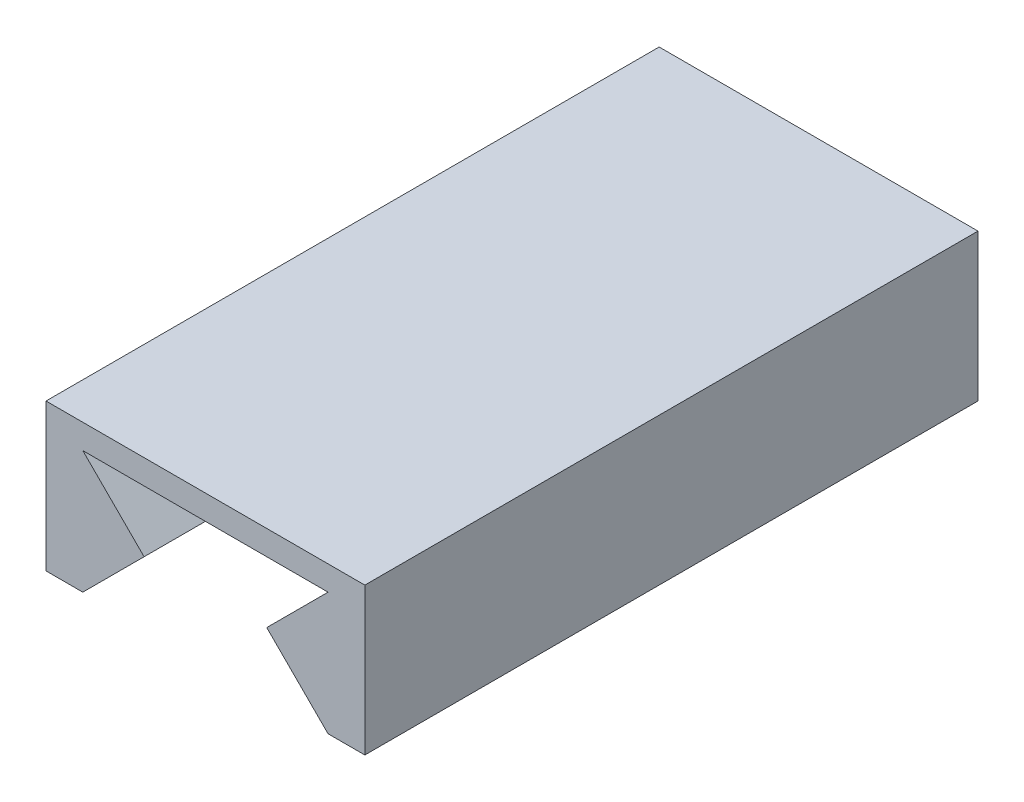
ISO-10303-21;
HEADER;
FILE_DESCRIPTION(('STEP AP214'),'2;1');
FILE_NAME('part.step','',(''),(''),'','','');
FILE_SCHEMA(('AUTOMOTIVE_DESIGN { 1 0 10303 214 1 1 1 1 }'));
ENDSEC;
DATA;
#1=APPLICATION_CONTEXT('core data for automotive mechanical design processes');
#2=APPLICATION_PROTOCOL_DEFINITION('international standard','automotive_design',2000,#1);
#3=PRODUCT_CONTEXT('',#1,'mechanical');
#4=PRODUCT('Part','Part','',(#3));
#5=PRODUCT_RELATED_PRODUCT_CATEGORY('part','',(#4));
#6=PRODUCT_DEFINITION_FORMATION('','',#4);
#7=PRODUCT_DEFINITION_CONTEXT('part definition',#1,'design');
#8=PRODUCT_DEFINITION('design','',#6,#7);
#9=PRODUCT_DEFINITION_SHAPE('','',#8);
#10=(LENGTH_UNIT() NAMED_UNIT(*) SI_UNIT(.MILLI.,.METRE.));
#11=(NAMED_UNIT(*) PLANE_ANGLE_UNIT() SI_UNIT($,.RADIAN.));
#12=(NAMED_UNIT(*) SI_UNIT($,.STERADIAN.) SOLID_ANGLE_UNIT());
#13=UNCERTAINTY_MEASURE_WITH_UNIT(LENGTH_MEASURE(1.E-05),#10,'distance_accuracy_value','');
#14=(GEOMETRIC_REPRESENTATION_CONTEXT(3) GLOBAL_UNCERTAINTY_ASSIGNED_CONTEXT((#13)) GLOBAL_UNIT_ASSIGNED_CONTEXT((#10,
#11,#12)) REPRESENTATION_CONTEXT('',''));
#15=CARTESIAN_POINT('',(0.,0.,0.));
#16=DIRECTION('',(0.,0.,1.));
#17=DIRECTION('',(1.,0.,0.));
#18=AXIS2_PLACEMENT_3D('',#15,#16,#17);
#19=CARTESIAN_POINT('',(0.,0.,50.));
#20=DIRECTION('',(-0.707106781186544,-0.707106781186552,0.));
#21=DIRECTION('',(0.707106781186551,-0.707106781186544,0.));
#22=AXIS2_PLACEMENT_3D('',#19,#20,#21);
#23=PLANE('',#22);
#24=DIRECTION('',(-0.707106781186551,0.707106781186544,0.));
#25=VECTOR('',#24,1.);
#26=CARTESIAN_POINT('',(0.,0.,0.));
#27=LINE('',#26,#25);
#28=CARTESIAN_POINT('',(0.,0.,0.));
#29=VERTEX_POINT('',#28);
#30=CARTESIAN_POINT('',(-5.00000000000006,5.,0.));
#31=VERTEX_POINT('',#30);
#32=EDGE_CURVE('E140',#29,#31,#27,.T.);
#33=ORIENTED_EDGE('',*,*,#32,.T.);
#34=DIRECTION('',(0.,0.,-1.));
#35=VECTOR('',#34,1.);
#36=CARTESIAN_POINT('',(-5.00000000000006,5.,50.));
#37=LINE('',#36,#35);
#38=CARTESIAN_POINT('',(-5.00000000000006,5.,50.));
#39=VERTEX_POINT('',#38);
#40=EDGE_CURVE('E11',#39,#31,#37,.T.);
#41=ORIENTED_EDGE('',*,*,#40,.F.);
#42=DIRECTION('',(-0.707106781186551,0.707106781186544,0.));
#43=VECTOR('',#42,1.);
#44=CARTESIAN_POINT('',(0.,0.,50.));
#45=LINE('',#44,#43);
#46=CARTESIAN_POINT('',(0.,0.,50.));
#47=VERTEX_POINT('',#46);
#48=EDGE_CURVE('E158',#47,#39,#45,.T.);
#49=ORIENTED_EDGE('',*,*,#48,.F.);
#50=DIRECTION('',(0.,0.,-1.));
#51=VECTOR('',#50,1.);
#52=CARTESIAN_POINT('',(0.,0.,50.));
#53=LINE('',#52,#51);
#54=EDGE_CURVE('E136',#47,#29,#53,.T.);
#55=ORIENTED_EDGE('',*,*,#54,.T.);
#56=EDGE_LOOP('',(#33,#41,#49,#55));
#57=FACE_BOUND('',#56,.T.);
#58=ADVANCED_FACE('F32',(#57),#23,.F.);
#59=CARTESIAN_POINT('',(-5.00000000000006,5.,50.));
#60=DIRECTION('',(0.,1.,0.));
#61=DIRECTION('',(-1.,0.,0.));
#62=AXIS2_PLACEMENT_3D('',#59,#60,#61);
#63=PLANE('',#62);
#64=DIRECTION('',(1.,0.,0.));
#65=VECTOR('',#64,1.);
#66=CARTESIAN_POINT('',(-5.00000000000006,5.,0.));
#67=LINE('',#66,#65);
#68=CARTESIAN_POINT('',(14.9999999999999,5.,0.));
#69=VERTEX_POINT('',#68);
#70=EDGE_CURVE('E143',#31,#69,#67,.T.);
#71=ORIENTED_EDGE('',*,*,#70,.T.);
#72=DIRECTION('',(0.,0.,-1.));
#73=VECTOR('',#72,1.);
#74=CARTESIAN_POINT('',(14.9999999999999,5.,50.));
#75=LINE('',#74,#73);
#76=CARTESIAN_POINT('',(14.9999999999999,5.,50.));
#77=VERTEX_POINT('',#76);
#78=EDGE_CURVE('E40',#77,#69,#75,.T.);
#79=ORIENTED_EDGE('',*,*,#78,.F.);
#80=DIRECTION('',(1.,0.,0.));
#81=VECTOR('',#80,1.);
#82=CARTESIAN_POINT('',(-5.00000000000006,5.,50.));
#83=LINE('',#82,#81);
#84=EDGE_CURVE('E97',#39,#77,#83,.T.);
#85=ORIENTED_EDGE('',*,*,#84,.F.);
#86=ORIENTED_EDGE('',*,*,#40,.T.);
#87=EDGE_LOOP('',(#71,#79,#85,#86));
#88=FACE_BOUND('',#87,.T.);
#89=ADVANCED_FACE('F207',(#88),#63,.F.);
#90=CARTESIAN_POINT('',(14.9999999999999,5.,50.));
#91=DIRECTION('',(0.707106781186544,-0.707106781186551,0.));
#92=DIRECTION('',(0.707106781186551,0.707106781186544,0.));
#93=AXIS2_PLACEMENT_3D('',#90,#91,#92);
#94=PLANE('',#93);
#95=DIRECTION('',(-0.707106781186551,-0.707106781186544,0.));
#96=VECTOR('',#95,1.);
#97=CARTESIAN_POINT('',(14.9999999999999,5.,0.));
#98=LINE('',#97,#96);
#99=CARTESIAN_POINT('',(9.99999999999989,0.,0.));
#100=VERTEX_POINT('',#99);
#101=EDGE_CURVE('E145',#69,#100,#98,.T.);
#102=ORIENTED_EDGE('',*,*,#101,.T.);
#103=DIRECTION('',(0.,0.,-1.));
#104=VECTOR('',#103,1.);
#105=CARTESIAN_POINT('',(9.99999999999989,0.,50.));
#106=LINE('',#105,#104);
#107=CARTESIAN_POINT('',(9.99999999999989,0.,50.));
#108=VERTEX_POINT('',#107);
#109=EDGE_CURVE('E171',#108,#100,#106,.T.);
#110=ORIENTED_EDGE('',*,*,#109,.F.);
#111=DIRECTION('',(-0.707106781186551,-0.707106781186544,0.));
#112=VECTOR('',#111,1.);
#113=CARTESIAN_POINT('',(14.9999999999999,5.,50.));
#114=LINE('',#113,#112);
#115=EDGE_CURVE('E179',#77,#108,#114,.T.);
#116=ORIENTED_EDGE('',*,*,#115,.F.);
#117=ORIENTED_EDGE('',*,*,#78,.T.);
#118=EDGE_LOOP('',(#102,#110,#116,#117));
#119=FACE_BOUND('',#118,.T.);
#120=ADVANCED_FACE('F177',(#119),#94,.F.);
#121=CARTESIAN_POINT('',(9.99999999999989,0.,50.));
#122=DIRECTION('',(0.707106781186543,0.707106781186552,0.));
#123=DIRECTION('',(-0.707106781186552,0.707106781186543,0.));
#124=AXIS2_PLACEMENT_3D('',#121,#122,#123);
#125=PLANE('',#124);
#126=DIRECTION('',(0.707106781186552,-0.707106781186543,0.));
#127=VECTOR('',#126,1.);
#128=CARTESIAN_POINT('',(9.99999999999989,0.,0.));
#129=LINE('',#128,#127);
#130=CARTESIAN_POINT('',(14.9999999999999,-5.,0.));
#131=VERTEX_POINT('',#130);
#132=EDGE_CURVE('E147',#100,#131,#129,.T.);
#133=ORIENTED_EDGE('',*,*,#132,.T.);
#134=DIRECTION('',(0.,0.,-1.));
#135=VECTOR('',#134,1.);
#136=CARTESIAN_POINT('',(14.9999999999999,-5.,50.));
#137=LINE('',#136,#135);
#138=CARTESIAN_POINT('',(14.9999999999999,-5.,50.));
#139=VERTEX_POINT('',#138);
#140=EDGE_CURVE('E168',#139,#131,#137,.T.);
#141=ORIENTED_EDGE('',*,*,#140,.F.);
#142=DIRECTION('',(0.707106781186552,-0.707106781186543,0.));
#143=VECTOR('',#142,1.);
#144=CARTESIAN_POINT('',(9.99999999999989,0.,50.));
#145=LINE('',#144,#143);
#146=EDGE_CURVE('E197',#108,#139,#145,.T.);
#147=ORIENTED_EDGE('',*,*,#146,.F.);
#148=ORIENTED_EDGE('',*,*,#109,.T.);
#149=EDGE_LOOP('',(#133,#141,#147,#148));
#150=FACE_BOUND('',#149,.T.);
#151=ADVANCED_FACE('F188',(#150),#125,.F.);
#152=CARTESIAN_POINT('',(14.9999999999999,-5.,50.));
#153=DIRECTION('',(0.,1.,0.));
#154=DIRECTION('',(0.,0.,1.));
#155=AXIS2_PLACEMENT_3D('',#152,#153,#154);
#156=PLANE('',#155);
#157=DIRECTION('',(1.,0.,0.));
#158=VECTOR('',#157,1.);
#159=CARTESIAN_POINT('',(14.9999999999999,-5.,0.));
#160=LINE('',#159,#158);
#161=CARTESIAN_POINT('',(17.9999999999999,-5.,0.));
#162=VERTEX_POINT('',#161);
#163=EDGE_CURVE('E149',#131,#162,#160,.T.);
#164=ORIENTED_EDGE('',*,*,#163,.T.);
#165=DIRECTION('',(0.,0.,-1.));
#166=VECTOR('',#165,1.);
#167=CARTESIAN_POINT('',(17.9999999999999,-5.,50.));
#168=LINE('',#167,#166);
#169=CARTESIAN_POINT('',(17.9999999999999,-5.,50.));
#170=VERTEX_POINT('',#169);
#171=EDGE_CURVE('E165',#170,#162,#168,.T.);
#172=ORIENTED_EDGE('',*,*,#171,.F.);
#173=DIRECTION('',(1.,0.,0.));
#174=VECTOR('',#173,1.);
#175=CARTESIAN_POINT('',(14.9999999999999,-5.,50.));
#176=LINE('',#175,#174);
#177=EDGE_CURVE('E194',#139,#170,#176,.T.);
#178=ORIENTED_EDGE('',*,*,#177,.F.);
#179=ORIENTED_EDGE('',*,*,#140,.T.);
#180=EDGE_LOOP('',(#164,#172,#178,#179));
#181=FACE_BOUND('',#180,.T.);
#182=ADVANCED_FACE('F192',(#181),#156,.F.);
#183=CARTESIAN_POINT('',(17.9999999999999,-5.,50.));
#184=DIRECTION('',(-1.,0.,0.));
#185=DIRECTION('',(0.,-1.,0.));
#186=AXIS2_PLACEMENT_3D('',#183,#184,#185);
#187=PLANE('',#186);
#188=DIRECTION('',(0.,1.,0.));
#189=VECTOR('',#188,1.);
#190=CARTESIAN_POINT('',(17.9999999999999,-5.,0.));
#191=LINE('',#190,#189);
#192=CARTESIAN_POINT('',(17.9999999999999,7.,0.));
#193=VERTEX_POINT('',#192);
#194=EDGE_CURVE('E151',#162,#193,#191,.T.);
#195=ORIENTED_EDGE('',*,*,#194,.T.);
#196=DIRECTION('',(0.,0.,-1.));
#197=VECTOR('',#196,1.);
#198=CARTESIAN_POINT('',(17.9999999999999,7.,50.));
#199=LINE('',#198,#197);
#200=CARTESIAN_POINT('',(17.9999999999999,7.,50.));
#201=VERTEX_POINT('',#200);
#202=EDGE_CURVE('E162',#201,#193,#199,.T.);
#203=ORIENTED_EDGE('',*,*,#202,.F.);
#204=DIRECTION('',(0.,1.,0.));
#205=VECTOR('',#204,1.);
#206=CARTESIAN_POINT('',(17.9999999999999,-5.,50.));
#207=LINE('',#206,#205);
#208=EDGE_CURVE('E196',#170,#201,#207,.T.);
#209=ORIENTED_EDGE('',*,*,#208,.F.);
#210=ORIENTED_EDGE('',*,*,#171,.T.);
#211=EDGE_LOOP('',(#195,#203,#209,#210));
#212=FACE_BOUND('',#211,.T.);
#213=ADVANCED_FACE('F219',(#212),#187,.F.);
#214=CARTESIAN_POINT('',(17.9999999999999,7.,50.));
#215=DIRECTION('',(0.,-1.,0.));
#216=DIRECTION('',(0.,0.,-1.));
#217=AXIS2_PLACEMENT_3D('',#214,#215,#216);
#218=PLANE('',#217);
#219=DIRECTION('',(-1.,0.,0.));
#220=VECTOR('',#219,1.);
#221=CARTESIAN_POINT('',(17.9999999999999,7.,0.));
#222=LINE('',#221,#220);
#223=CARTESIAN_POINT('',(-8.00000000000006,7.,0.));
#224=VERTEX_POINT('',#223);
#225=EDGE_CURVE('E153',#193,#224,#222,.T.);
#226=ORIENTED_EDGE('',*,*,#225,.T.);
#227=DIRECTION('',(0.,0.,-1.));
#228=VECTOR('',#227,1.);
#229=CARTESIAN_POINT('',(-8.00000000000006,7.,50.));
#230=LINE('',#229,#228);
#231=CARTESIAN_POINT('',(-8.00000000000006,7.,50.));
#232=VERTEX_POINT('',#231);
#233=EDGE_CURVE('E131',#232,#224,#230,.T.);
#234=ORIENTED_EDGE('',*,*,#233,.F.);
#235=DIRECTION('',(-1.,0.,0.));
#236=VECTOR('',#235,1.);
#237=CARTESIAN_POINT('',(17.9999999999999,7.,50.));
#238=LINE('',#237,#236);
#239=EDGE_CURVE('E122',#201,#232,#238,.T.);
#240=ORIENTED_EDGE('',*,*,#239,.F.);
#241=ORIENTED_EDGE('',*,*,#202,.T.);
#242=EDGE_LOOP('',(#226,#234,#240,#241));
#243=FACE_BOUND('',#242,.T.);
#244=ADVANCED_FACE('F222',(#243),#218,.F.);
#245=CARTESIAN_POINT('',(-8.00000000000006,7.,50.));
#246=DIRECTION('',(1.,0.,0.));
#247=DIRECTION('',(0.,1.,0.));
#248=AXIS2_PLACEMENT_3D('',#245,#246,#247);
#249=PLANE('',#248);
#250=DIRECTION('',(0.,-1.,0.));
#251=VECTOR('',#250,1.);
#252=CARTESIAN_POINT('',(-8.00000000000006,7.,0.));
#253=LINE('',#252,#251);
#254=CARTESIAN_POINT('',(-8.00000000000005,-5.,0.));
#255=VERTEX_POINT('',#254);
#256=EDGE_CURVE('E130',#224,#255,#253,.T.);
#257=ORIENTED_EDGE('',*,*,#256,.T.);
#258=DIRECTION('',(0.,0.,-1.));
#259=VECTOR('',#258,1.);
#260=CARTESIAN_POINT('',(-8.00000000000005,-5.,50.));
#261=LINE('',#260,#259);
#262=CARTESIAN_POINT('',(-8.00000000000005,-5.,50.));
#263=VERTEX_POINT('',#262);
#264=EDGE_CURVE('E127',#263,#255,#261,.T.);
#265=ORIENTED_EDGE('',*,*,#264,.F.);
#266=DIRECTION('',(0.,-1.,0.));
#267=VECTOR('',#266,1.);
#268=CARTESIAN_POINT('',(-8.00000000000006,7.,50.));
#269=LINE('',#268,#267);
#270=EDGE_CURVE('E116',#232,#263,#269,.T.);
#271=ORIENTED_EDGE('',*,*,#270,.F.);
#272=ORIENTED_EDGE('',*,*,#233,.T.);
#273=EDGE_LOOP('',(#257,#265,#271,#272));
#274=FACE_BOUND('',#273,.T.);
#275=ADVANCED_FACE('F128',(#274),#249,.F.);
#276=CARTESIAN_POINT('',(-8.00000000000005,-5.,50.));
#277=DIRECTION('',(0.,1.,0.));
#278=DIRECTION('',(-1.,0.,0.));
#279=AXIS2_PLACEMENT_3D('',#276,#277,#278);
#280=PLANE('',#279);
#281=DIRECTION('',(1.,0.,0.));
#282=VECTOR('',#281,1.);
#283=CARTESIAN_POINT('',(-8.00000000000005,-5.,0.));
#284=LINE('',#283,#282);
#285=CARTESIAN_POINT('',(-5.00000000000005,-5.,0.));
#286=VERTEX_POINT('',#285);
#287=EDGE_CURVE('E83',#255,#286,#284,.T.);
#288=ORIENTED_EDGE('',*,*,#287,.T.);
#289=DIRECTION('',(0.,0.,-1.));
#290=VECTOR('',#289,1.);
#291=CARTESIAN_POINT('',(-5.00000000000005,-5.,50.));
#292=LINE('',#291,#290);
#293=CARTESIAN_POINT('',(-5.00000000000005,-5.,50.));
#294=VERTEX_POINT('',#293);
#295=EDGE_CURVE('E132',#294,#286,#292,.T.);
#296=ORIENTED_EDGE('',*,*,#295,.F.);
#297=DIRECTION('',(1.,0.,0.));
#298=VECTOR('',#297,1.);
#299=CARTESIAN_POINT('',(-8.00000000000005,-5.,50.));
#300=LINE('',#299,#298);
#301=EDGE_CURVE('E120',#263,#294,#300,.T.);
#302=ORIENTED_EDGE('',*,*,#301,.F.);
#303=ORIENTED_EDGE('',*,*,#264,.T.);
#304=EDGE_LOOP('',(#288,#296,#302,#303));
#305=FACE_BOUND('',#304,.T.);
#306=ADVANCED_FACE('F134',(#305),#280,.F.);
#307=CARTESIAN_POINT('',(0.,0.,50.));
#308=DIRECTION('',(-0.707106781186544,0.707106781186551,0.));
#309=DIRECTION('',(-0.707106781186551,-0.707106781186544,0.));
#310=AXIS2_PLACEMENT_3D('',#307,#308,#309);
#311=PLANE('',#310);
#312=DIRECTION('',(0.707106781186551,0.707106781186544,0.));
#313=VECTOR('',#312,1.);
#314=CARTESIAN_POINT('',(0.,0.,0.));
#315=LINE('',#314,#313);
#316=EDGE_CURVE('E89',#286,#29,#315,.T.);
#317=ORIENTED_EDGE('',*,*,#316,.T.);
#318=ORIENTED_EDGE('',*,*,#54,.F.);
#319=DIRECTION('',(0.707106781186551,0.707106781186544,0.));
#320=VECTOR('',#319,1.);
#321=CARTESIAN_POINT('',(0.,0.,50.));
#322=LINE('',#321,#320);
#323=EDGE_CURVE('E48',#294,#47,#322,.T.);
#324=ORIENTED_EDGE('',*,*,#323,.F.);
#325=ORIENTED_EDGE('',*,*,#295,.T.);
#326=EDGE_LOOP('',(#317,#318,#324,#325));
#327=FACE_BOUND('',#326,.T.);
#328=ADVANCED_FACE('F231',(#327),#311,.F.);
#329=CARTESIAN_POINT('',(0.,0.,50.));
#330=DIRECTION('',(0.,0.,1.));
#331=DIRECTION('',(1.,0.,0.));
#332=AXIS2_PLACEMENT_3D('',#329,#330,#331);
#333=PLANE('',#332);
#334=ORIENTED_EDGE('',*,*,#48,.T.);
#335=ORIENTED_EDGE('',*,*,#84,.T.);
#336=ORIENTED_EDGE('',*,*,#115,.T.);
#337=ORIENTED_EDGE('',*,*,#146,.T.);
#338=ORIENTED_EDGE('',*,*,#177,.T.);
#339=ORIENTED_EDGE('',*,*,#208,.T.);
#340=ORIENTED_EDGE('',*,*,#239,.T.);
#341=ORIENTED_EDGE('',*,*,#270,.T.);
#342=ORIENTED_EDGE('',*,*,#301,.T.);
#343=ORIENTED_EDGE('',*,*,#323,.T.);
#344=EDGE_LOOP('',(#334,#335,#336,#337,#338,#339,#340,#341,#342,#343));
#345=FACE_BOUND('',#344,.T.);
#346=ADVANCED_FACE('F118',(#345),#333,.T.);
#347=CARTESIAN_POINT('',(0.,0.,0.));
#348=DIRECTION('',(0.,0.,1.));
#349=DIRECTION('',(1.,0.,0.));
#350=AXIS2_PLACEMENT_3D('',#347,#348,#349);
#351=PLANE('',#350);
#352=ORIENTED_EDGE('',*,*,#32,.F.);
#353=ORIENTED_EDGE('',*,*,#316,.F.);
#354=ORIENTED_EDGE('',*,*,#287,.F.);
#355=ORIENTED_EDGE('',*,*,#256,.F.);
#356=ORIENTED_EDGE('',*,*,#225,.F.);
#357=ORIENTED_EDGE('',*,*,#194,.F.);
#358=ORIENTED_EDGE('',*,*,#163,.F.);
#359=ORIENTED_EDGE('',*,*,#132,.F.);
#360=ORIENTED_EDGE('',*,*,#101,.F.);
#361=ORIENTED_EDGE('',*,*,#70,.F.);
#362=EDGE_LOOP('',(#352,#353,#354,#355,#356,#357,#358,#359,#360,#361));
#363=FACE_BOUND('',#362,.T.);
#364=ADVANCED_FACE('F183',(#363),#351,.F.);
#365=CLOSED_SHELL('',(#58,#89,#120,#151,#182,#213,#244,#275,#306,#328,#346,#364));
#366=MANIFOLD_SOLID_BREP('B2',#365);
#367=ADVANCED_BREP_SHAPE_REPRESENTATION('',(#18,#366),#14);
#368=SHAPE_DEFINITION_REPRESENTATION(#9,#367);
ENDSEC;
END-ISO-10303-21;
